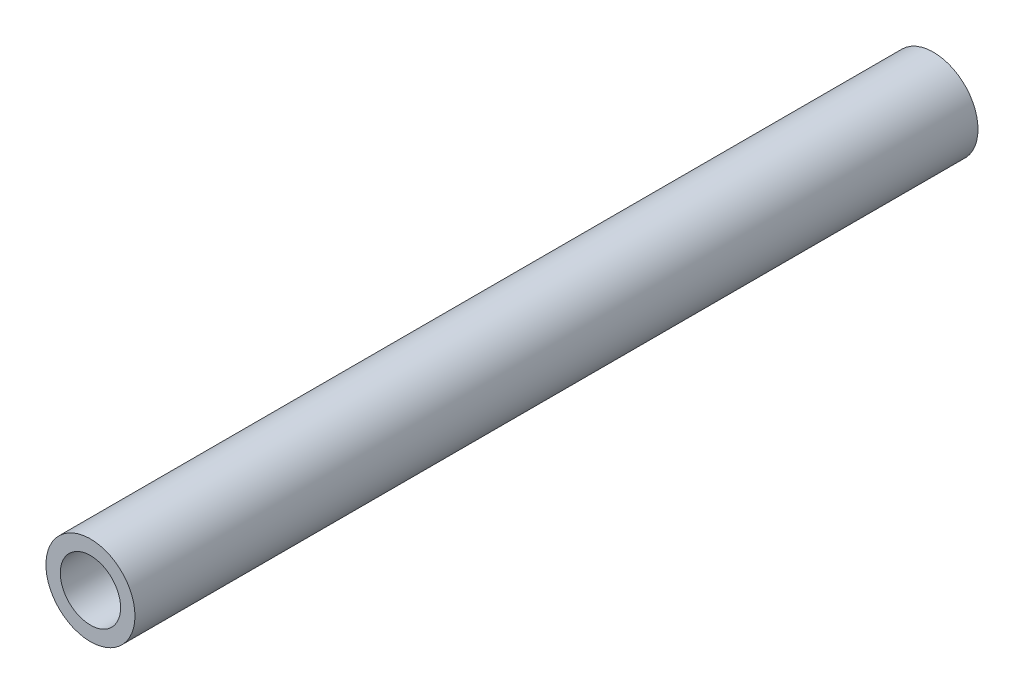
ISO-10303-21;
HEADER;
FILE_DESCRIPTION(('STEP AP214'),'2;1');
FILE_NAME('part.step','',(''),(''),'','','');
FILE_SCHEMA(('AUTOMOTIVE_DESIGN { 1 0 10303 214 1 1 1 1 }'));
ENDSEC;
DATA;
#1=APPLICATION_CONTEXT('core data for automotive mechanical design processes');
#2=APPLICATION_PROTOCOL_DEFINITION('international standard','automotive_design',2000,#1);
#3=PRODUCT_CONTEXT('',#1,'mechanical');
#4=PRODUCT('Part','Part','',(#3));
#5=PRODUCT_RELATED_PRODUCT_CATEGORY('part','',(#4));
#6=PRODUCT_DEFINITION_FORMATION('','',#4);
#7=PRODUCT_DEFINITION_CONTEXT('part definition',#1,'design');
#8=PRODUCT_DEFINITION('design','',#6,#7);
#9=PRODUCT_DEFINITION_SHAPE('','',#8);
#10=(LENGTH_UNIT() NAMED_UNIT(*) SI_UNIT(.MILLI.,.METRE.));
#11=(NAMED_UNIT(*) PLANE_ANGLE_UNIT() SI_UNIT($,.RADIAN.));
#12=(NAMED_UNIT(*) SI_UNIT($,.STERADIAN.) SOLID_ANGLE_UNIT());
#13=UNCERTAINTY_MEASURE_WITH_UNIT(LENGTH_MEASURE(1.E-05),#10,'distance_accuracy_value','');
#14=(GEOMETRIC_REPRESENTATION_CONTEXT(3) GLOBAL_UNCERTAINTY_ASSIGNED_CONTEXT((#13)) GLOBAL_UNIT_ASSIGNED_CONTEXT((#10,
#11,#12)) REPRESENTATION_CONTEXT('',''));
#15=CARTESIAN_POINT('',(0.,0.,0.));
#16=DIRECTION('',(0.,0.,1.));
#17=DIRECTION('',(1.,0.,0.));
#18=AXIS2_PLACEMENT_3D('',#15,#16,#17);
#19=CARTESIAN_POINT('',(0.,0.,180.34));
#20=DIRECTION('',(0.,0.,1.));
#21=DIRECTION('',(1.,0.,0.));
#22=AXIS2_PLACEMENT_3D('',#19,#20,#21);
#23=PLANE('',#22);
#24=CARTESIAN_POINT('',(0.,0.,180.34));
#25=DIRECTION('',(0.,0.,1.));
#26=DIRECTION('',(1.,0.,0.));
#27=AXIS2_PLACEMENT_3D('',#24,#25,#26);
#28=CIRCLE('',#27,9.525);
#29=CARTESIAN_POINT('',(9.525,0.,180.34));
#30=VERTEX_POINT('',#29);
#31=EDGE_CURVE('E10',#30,#30,#28,.T.);
#32=ORIENTED_EDGE('',*,*,#31,.T.);
#33=EDGE_LOOP('',(#32));
#34=FACE_BOUND('',#33,.T.);
#35=CARTESIAN_POINT('',(0.,0.,180.34));
#36=DIRECTION('',(0.,0.,1.));
#37=DIRECTION('',(1.,0.,0.));
#38=AXIS2_PLACEMENT_3D('',#35,#36,#37);
#39=CIRCLE('',#38,6.45);
#40=CARTESIAN_POINT('',(6.45,0.,180.34));
#41=VERTEX_POINT('',#40);
#42=EDGE_CURVE('E48',#41,#41,#39,.T.);
#43=ORIENTED_EDGE('',*,*,#42,.F.);
#44=EDGE_LOOP('',(#43));
#45=FACE_BOUND('',#44,.T.);
#46=ADVANCED_FACE('F37',(#34,#45),#23,.T.);
#47=CARTESIAN_POINT('',(0.,0.,0.));
#48=DIRECTION('',(0.,0.,1.));
#49=DIRECTION('',(1.,0.,0.));
#50=AXIS2_PLACEMENT_3D('',#47,#48,#49);
#51=PLANE('',#50);
#52=CARTESIAN_POINT('',(0.,0.,0.));
#53=DIRECTION('',(0.,0.,1.));
#54=DIRECTION('',(1.,0.,0.));
#55=AXIS2_PLACEMENT_3D('',#52,#53,#54);
#56=CIRCLE('',#55,9.525);
#57=CARTESIAN_POINT('',(9.525,0.,0.));
#58=VERTEX_POINT('',#57);
#59=EDGE_CURVE('E41',#58,#58,#56,.T.);
#60=ORIENTED_EDGE('',*,*,#59,.F.);
#61=EDGE_LOOP('',(#60));
#62=FACE_BOUND('',#61,.T.);
#63=CARTESIAN_POINT('',(0.,0.,0.));
#64=DIRECTION('',(0.,0.,1.));
#65=DIRECTION('',(1.,0.,0.));
#66=AXIS2_PLACEMENT_3D('',#63,#64,#65);
#67=CIRCLE('',#66,6.45);
#68=CARTESIAN_POINT('',(6.45,0.,0.));
#69=VERTEX_POINT('',#68);
#70=EDGE_CURVE('E50',#69,#69,#67,.T.);
#71=ORIENTED_EDGE('',*,*,#70,.T.);
#72=EDGE_LOOP('',(#71));
#73=FACE_BOUND('',#72,.T.);
#74=ADVANCED_FACE('F60',(#62,#73),#51,.F.);
#75=CARTESIAN_POINT('',(0.,0.,180.34));
#76=DIRECTION('',(0.,0.,-1.));
#77=DIRECTION('',(-1.,0.,0.));
#78=AXIS2_PLACEMENT_3D('',#75,#76,#77);
#79=CYLINDRICAL_SURFACE('',#78,9.525);
#80=ORIENTED_EDGE('',*,*,#31,.F.);
#81=EDGE_LOOP('',(#80));
#82=FACE_BOUND('',#81,.T.);
#83=ORIENTED_EDGE('',*,*,#59,.T.);
#84=EDGE_LOOP('',(#83));
#85=FACE_BOUND('',#84,.T.);
#86=ADVANCED_FACE('F39',(#82,#85),#79,.T.);
#87=CARTESIAN_POINT('',(0.,0.,180.34));
#88=DIRECTION('',(0.,0.,-1.));
#89=DIRECTION('',(-1.,0.,0.));
#90=AXIS2_PLACEMENT_3D('',#87,#88,#89);
#91=CYLINDRICAL_SURFACE('',#90,6.45);
#92=ORIENTED_EDGE('',*,*,#42,.T.);
#93=EDGE_LOOP('',(#92));
#94=FACE_BOUND('',#93,.T.);
#95=ORIENTED_EDGE('',*,*,#70,.F.);
#96=EDGE_LOOP('',(#95));
#97=FACE_BOUND('',#96,.T.);
#98=ADVANCED_FACE('F56',(#94,#97),#91,.F.);
#99=CLOSED_SHELL('',(#46,#74,#86,#98));
#100=MANIFOLD_SOLID_BREP('B2',#99);
#101=ADVANCED_BREP_SHAPE_REPRESENTATION('',(#18,#100),#14);
#102=SHAPE_DEFINITION_REPRESENTATION(#9,#101);
ENDSEC;
END-ISO-10303-21;
